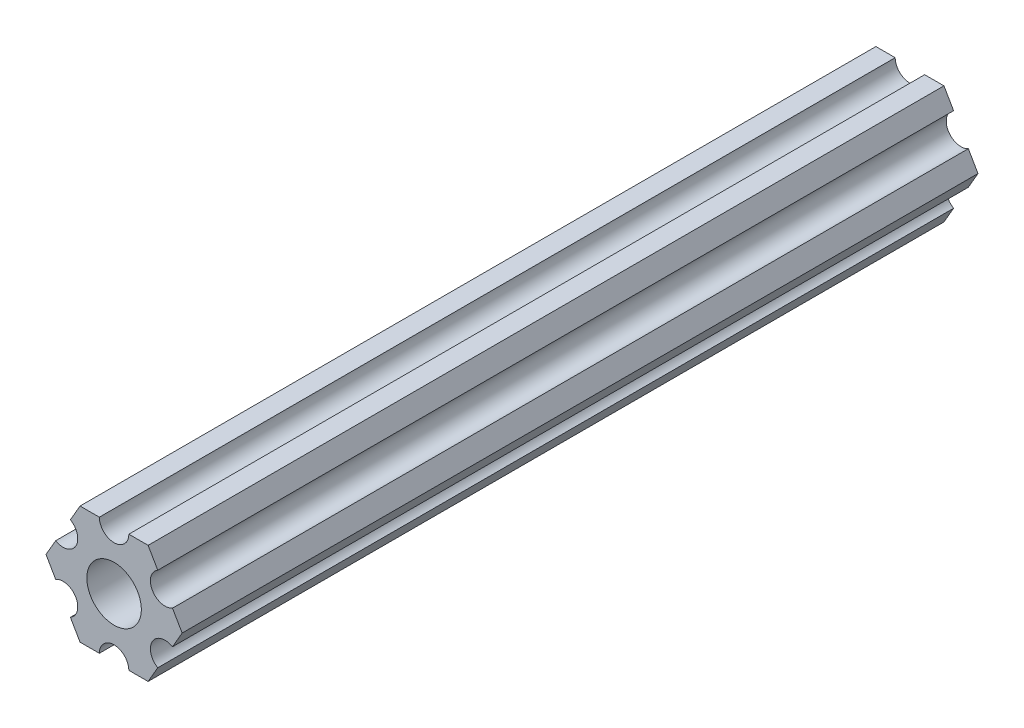
ISO-10303-21;
HEADER;
FILE_DESCRIPTION(('STEP AP214'),'2;1');
FILE_NAME('part.step','',(''),(''),'','','');
FILE_SCHEMA(('AUTOMOTIVE_DESIGN { 1 0 10303 214 1 1 1 1 }'));
ENDSEC;
DATA;
#1=APPLICATION_CONTEXT('core data for automotive mechanical design processes');
#2=APPLICATION_PROTOCOL_DEFINITION('international standard','automotive_design',2000,#1);
#3=PRODUCT_CONTEXT('',#1,'mechanical');
#4=PRODUCT('Part','Part','',(#3));
#5=PRODUCT_RELATED_PRODUCT_CATEGORY('part','',(#4));
#6=PRODUCT_DEFINITION_FORMATION('','',#4);
#7=PRODUCT_DEFINITION_CONTEXT('part definition',#1,'design');
#8=PRODUCT_DEFINITION('design','',#6,#7);
#9=PRODUCT_DEFINITION_SHAPE('','',#8);
#10=(LENGTH_UNIT() NAMED_UNIT(*) SI_UNIT(.MILLI.,.METRE.));
#11=(NAMED_UNIT(*) PLANE_ANGLE_UNIT() SI_UNIT($,.RADIAN.));
#12=(NAMED_UNIT(*) SI_UNIT($,.STERADIAN.) SOLID_ANGLE_UNIT());
#13=UNCERTAINTY_MEASURE_WITH_UNIT(LENGTH_MEASURE(1.E-05),#10,'distance_accuracy_value','');
#14=(GEOMETRIC_REPRESENTATION_CONTEXT(3) GLOBAL_UNCERTAINTY_ASSIGNED_CONTEXT((#13)) GLOBAL_UNIT_ASSIGNED_CONTEXT((#10,
#11,#12)) REPRESENTATION_CONTEXT('',''));
#15=CARTESIAN_POINT('',(0.,0.,0.));
#16=DIRECTION('',(0.,0.,1.));
#17=DIRECTION('',(1.,0.,0.));
#18=AXIS2_PLACEMENT_3D('',#15,#16,#17);
#19=CARTESIAN_POINT('',(6.29301142309098,-1.80018429024546,85.725));
#20=DIRECTION('',(-0.866025434075723,0.499999947533953,0.));
#21=DIRECTION('',(-0.499999947533953,-0.866025434075723,0.));
#22=AXIS2_PLACEMENT_3D('',#19,#20,#21);
#23=PLANE('',#22);
#24=DIRECTION('',(0.,0.,1.));
#25=VECTOR('',#24,1.);
#26=CARTESIAN_POINT('',(7.33234841870826,4.44212519169686E-07,85.725));
#27=LINE('',#26,#25);
#28=CARTESIAN_POINT('',(7.33234841870826,4.44212518961143E-07,0.));
#29=VERTEX_POINT('',#28);
#30=CARTESIAN_POINT('',(7.33234841870826,4.44212519315656E-07,85.725));
#31=VERTEX_POINT('',#30);
#32=EDGE_CURVE('E343',#29,#31,#27,.T.);
#33=ORIENTED_EDGE('',*,*,#32,.T.);
#34=DIRECTION('',(0.499999947533953,0.866025434075723,0.));
#35=VECTOR('',#34,1.);
#36=CARTESIAN_POINT('',(6.29301142309098,-1.80018429024546,85.725));
#37=LINE('',#36,#35);
#38=CARTESIAN_POINT('',(6.29301142309098,-1.80018429024546,85.725));
#39=VERTEX_POINT('',#38);
#40=EDGE_CURVE('E208',#39,#31,#37,.T.);
#41=ORIENTED_EDGE('',*,*,#40,.F.);
#42=DIRECTION('',(0.,0.,-1.));
#43=VECTOR('',#42,1.);
#44=CARTESIAN_POINT('',(6.29301142309098,-1.80018429024546,85.725));
#45=LINE('',#44,#43);
#46=CARTESIAN_POINT('',(6.29301142309098,-1.80018429024546,0.));
#47=VERTEX_POINT('',#46);
#48=EDGE_CURVE('E253',#39,#47,#45,.T.);
#49=ORIENTED_EDGE('',*,*,#48,.T.);
#50=DIRECTION('',(0.499999947533953,0.866025434075723,0.));
#51=VECTOR('',#50,1.);
#52=CARTESIAN_POINT('',(6.29301142309098,-1.80018429024546,0.));
#53=LINE('',#52,#51);
#54=EDGE_CURVE('E211',#47,#29,#53,.T.);
#55=ORIENTED_EDGE('',*,*,#54,.T.);
#56=EDGE_LOOP('',(#33,#41,#49,#55));
#57=FACE_BOUND('',#56,.T.);
#58=ADVANCED_FACE('F19',(#57),#23,.F.);
#59=CARTESIAN_POINT('',(7.33234841870826,4.44212519169686E-07,85.725));
#60=DIRECTION('',(-0.866025373493145,-0.500000052466056,0.));
#61=DIRECTION('',(0.500000052466056,-0.866025373493145,0.));
#62=AXIS2_PLACEMENT_3D('',#59,#60,#61);
#63=PLANE('',#62);
#64=DIRECTION('',(0.,0.,-1.));
#65=VECTOR('',#64,1.);
#66=CARTESIAN_POINT('',(6.29301120497139,1.80018505273895,85.725));
#67=LINE('',#66,#65);
#68=CARTESIAN_POINT('',(6.29301120497139,1.80018505273895,0.));
#69=VERTEX_POINT('',#68);
#70=CARTESIAN_POINT('',(6.29301120497139,1.80018505273895,85.725));
#71=VERTEX_POINT('',#70);
#72=EDGE_CURVE('E336',#69,#71,#67,.F.);
#73=ORIENTED_EDGE('',*,*,#72,.T.);
#74=DIRECTION('',(-0.500000052466056,0.866025373493145,0.));
#75=VECTOR('',#74,1.);
#76=CARTESIAN_POINT('',(7.33234841870826,4.44212519198905E-07,85.725));
#77=LINE('',#76,#75);
#78=EDGE_CURVE('E77',#31,#71,#77,.T.);
#79=ORIENTED_EDGE('',*,*,#78,.F.);
#80=ORIENTED_EDGE('',*,*,#32,.F.);
#81=DIRECTION('',(-0.500000052466056,0.866025373493145,0.));
#82=VECTOR('',#81,1.);
#83=CARTESIAN_POINT('',(7.33234841870826,4.44212519198905E-07,0.));
#84=LINE('',#83,#82);
#85=EDGE_CURVE('E250',#29,#69,#84,.T.);
#86=ORIENTED_EDGE('',*,*,#85,.T.);
#87=EDGE_LOOP('',(#73,#79,#80,#86));
#88=FACE_BOUND('',#87,.T.);
#89=ADVANCED_FACE('F415',(#88),#63,.F.);
#90=CARTESIAN_POINT('',(5.49926112168156,3.17500033315933,85.725));
#91=DIRECTION('',(0.,0.,-1.));
#92=DIRECTION('',(-1.,0.,0.));
#93=AXIS2_PLACEMENT_3D('',#90,#91,#92);
#94=CYLINDRICAL_SURFACE('',#93,1.5875);
#95=CARTESIAN_POINT('',(5.49926112168156,3.17500033315933,85.725));
#96=DIRECTION('',(0.,0.,-1.));
#97=DIRECTION('',(-1.,0.,0.));
#98=AXIS2_PLACEMENT_3D('',#95,#96,#97);
#99=CIRCLE('',#98,1.5875);
#100=CARTESIAN_POINT('',(4.70551103839172,4.54981561357972,85.725));
#101=VERTEX_POINT('',#100);
#102=EDGE_CURVE('E66',#71,#101,#99,.T.);
#103=ORIENTED_EDGE('',*,*,#102,.F.);
#104=ORIENTED_EDGE('',*,*,#72,.F.);
#105=CARTESIAN_POINT('',(5.49926112168156,3.17500033315933,0.));
#106=DIRECTION('',(0.,0.,-1.));
#107=DIRECTION('',(-1.,0.,0.));
#108=AXIS2_PLACEMENT_3D('',#105,#106,#107);
#109=CIRCLE('',#108,1.5875);
#110=CARTESIAN_POINT('',(4.70551103839172,4.54981561357972,0.));
#111=VERTEX_POINT('',#110);
#112=EDGE_CURVE('E22',#69,#111,#109,.T.);
#113=ORIENTED_EDGE('',*,*,#112,.T.);
#114=DIRECTION('',(0.,0.,1.));
#115=VECTOR('',#114,1.);
#116=CARTESIAN_POINT('',(4.70551103839172,4.54981561357972,85.725));
#117=LINE('',#116,#115);
#118=EDGE_CURVE('E331',#111,#101,#117,.T.);
#119=ORIENTED_EDGE('',*,*,#118,.T.);
#120=EDGE_LOOP('',(#103,#104,#113,#119));
#121=FACE_BOUND('',#120,.T.);
#122=ADVANCED_FACE('F419',(#121),#94,.F.);
#123=CARTESIAN_POINT('',(4.70551103839172,4.54981561357972,85.725));
#124=DIRECTION('',(-0.866025373493151,-0.500000052466046,0.));
#125=DIRECTION('',(0.500000052466046,-0.866025373493151,0.));
#126=AXIS2_PLACEMENT_3D('',#123,#124,#125);
#127=PLANE('',#126);
#128=DIRECTION('',(0.,0.,1.));
#129=VECTOR('',#128,1.);
#130=CARTESIAN_POINT('',(3.66617382465481,6.35000022210627,85.725));
#131=LINE('',#130,#129);
#132=CARTESIAN_POINT('',(3.66617382465481,6.35000022210627,0.));
#133=VERTEX_POINT('',#132);
#134=CARTESIAN_POINT('',(3.66617382465481,6.35000022210627,85.725));
#135=VERTEX_POINT('',#134);
#136=EDGE_CURVE('E327',#133,#135,#131,.T.);
#137=ORIENTED_EDGE('',*,*,#136,.T.);
#138=DIRECTION('',(-0.500000052466046,0.866025373493151,0.));
#139=VECTOR('',#138,1.);
#140=CARTESIAN_POINT('',(4.70551103839172,4.54981561357972,85.725));
#141=LINE('',#140,#139);
#142=EDGE_CURVE('E203',#101,#135,#141,.T.);
#143=ORIENTED_EDGE('',*,*,#142,.F.);
#144=ORIENTED_EDGE('',*,*,#118,.F.);
#145=DIRECTION('',(-0.500000052466046,0.866025373493151,0.));
#146=VECTOR('',#145,1.);
#147=CARTESIAN_POINT('',(4.70551103839172,4.54981561357972,0.));
#148=LINE('',#147,#146);
#149=EDGE_CURVE('E247',#111,#133,#148,.T.);
#150=ORIENTED_EDGE('',*,*,#149,.T.);
#151=EDGE_LOOP('',(#137,#143,#144,#150));
#152=FACE_BOUND('',#151,.T.);
#153=ADVANCED_FACE('F422',(#152),#127,.F.);
#154=CARTESIAN_POINT('',(3.66617382465481,6.35000022210627,85.725));
#155=DIRECTION('',(6.05825850611185E-08,-0.999999999999998,0.));
#156=DIRECTION('',(0.999999999999998,6.05825850611185E-08,0.));
#157=AXIS2_PLACEMENT_3D('',#154,#155,#156);
#158=PLANE('',#157);
#159=DIRECTION('',(0.,0.,-1.));
#160=VECTOR('',#159,1.);
#161=CARTESIAN_POINT('',(1.58749961530074,6.35000009617482,85.725));
#162=LINE('',#161,#160);
#163=CARTESIAN_POINT('',(1.58749961530073,6.35000015914054,0.));
#164=VERTEX_POINT('',#163);
#165=CARTESIAN_POINT('',(1.58749961530073,6.35000015914054,85.725));
#166=VERTEX_POINT('',#165);
#167=EDGE_CURVE('E319',#164,#166,#162,.F.);
#168=ORIENTED_EDGE('',*,*,#167,.T.);
#169=DIRECTION('',(1.,0.,0.));
#170=VECTOR('',#169,1.);
#171=CARTESIAN_POINT('',(5.49926112168156,6.35000022210627,85.725));
#172=LINE('',#171,#170);
#173=EDGE_CURVE('E169',#135,#166,#172,.F.);
#174=ORIENTED_EDGE('',*,*,#173,.F.);
#175=ORIENTED_EDGE('',*,*,#136,.F.);
#176=DIRECTION('',(1.,0.,0.));
#177=VECTOR('',#176,1.);
#178=CARTESIAN_POINT('',(5.49926112168156,6.35000022210627,0.));
#179=LINE('',#178,#177);
#180=EDGE_CURVE('E244',#133,#164,#179,.F.);
#181=ORIENTED_EDGE('',*,*,#180,.T.);
#182=EDGE_LOOP('',(#168,#174,#175,#181));
#183=FACE_BOUND('',#182,.T.);
#184=ADVANCED_FACE('F325',(#183),#158,.F.);
#185=CARTESIAN_POINT('',(-3.84699260060323E-07,6.35,85.725));
#186=DIRECTION('',(0.,0.,-1.));
#187=DIRECTION('',(-1.,0.,0.));
#188=AXIS2_PLACEMENT_3D('',#185,#186,#187);
#189=CYLINDRICAL_SURFACE('',#188,1.5875);
#190=DIRECTION('',(0.,0.,1.));
#191=VECTOR('',#190,1.);
#192=CARTESIAN_POINT('',(-1.58750038469926,6.34999990382518,85.725));
#193=LINE('',#192,#191);
#194=CARTESIAN_POINT('',(-1.58750038469926,6.34999990382518,0.));
#195=VERTEX_POINT('',#194);
#196=CARTESIAN_POINT('',(-1.58750038469926,6.34999990382518,85.725));
#197=VERTEX_POINT('',#196);
#198=EDGE_CURVE('E122',#195,#197,#193,.T.);
#199=ORIENTED_EDGE('',*,*,#198,.T.);
#200=CARTESIAN_POINT('',(-3.84699260060323E-07,6.35,85.725));
#201=DIRECTION('',(0.,0.,-1.));
#202=DIRECTION('',(-1.,0.,0.));
#203=AXIS2_PLACEMENT_3D('',#200,#201,#202);
#204=CIRCLE('',#203,1.5875);
#205=EDGE_CURVE('E174',#166,#197,#204,.T.);
#206=ORIENTED_EDGE('',*,*,#205,.F.);
#207=ORIENTED_EDGE('',*,*,#167,.F.);
#208=CARTESIAN_POINT('',(-3.84699260060323E-07,6.35,0.));
#209=DIRECTION('',(0.,0.,-1.));
#210=DIRECTION('',(-1.,0.,0.));
#211=AXIS2_PLACEMENT_3D('',#208,#209,#210);
#212=CIRCLE('',#211,1.5875);
#213=EDGE_CURVE('E243',#164,#195,#212,.T.);
#214=ORIENTED_EDGE('',*,*,#213,.T.);
#215=EDGE_LOOP('',(#199,#206,#207,#214));
#216=FACE_BOUND('',#215,.T.);
#217=ADVANCED_FACE('F318',(#216),#189,.F.);
#218=CARTESIAN_POINT('',(-1.58750038469926,6.34999990382518,85.725));
#219=DIRECTION('',(6.05825963273174E-08,-0.999999999999998,0.));
#220=DIRECTION('',(0.999999999999998,6.05825963273174E-08,0.));
#221=AXIS2_PLACEMENT_3D('',#218,#219,#220);
#222=PLANE('',#221);
#223=DIRECTION('',(0.,0.,1.));
#224=VECTOR('',#223,1.);
#225=CARTESIAN_POINT('',(-3.66617459405349,6.3499997778937,85.725));
#226=LINE('',#225,#224);
#227=CARTESIAN_POINT('',(-3.66617454558244,6.34999986184803,0.));
#228=VERTEX_POINT('',#227);
#229=CARTESIAN_POINT('',(-3.66617454558244,6.34999986184803,85.725));
#230=VERTEX_POINT('',#229);
#231=EDGE_CURVE('E130',#228,#230,#226,.T.);
#232=ORIENTED_EDGE('',*,*,#231,.T.);
#233=DIRECTION('',(1.,0.,0.));
#234=VECTOR('',#233,1.);
#235=CARTESIAN_POINT('',(5.49926112168156,6.34999990382518,85.725));
#236=LINE('',#235,#234);
#237=EDGE_CURVE('E176',#197,#230,#236,.F.);
#238=ORIENTED_EDGE('',*,*,#237,.F.);
#239=ORIENTED_EDGE('',*,*,#198,.F.);
#240=DIRECTION('',(1.,0.,0.));
#241=VECTOR('',#240,1.);
#242=CARTESIAN_POINT('',(5.49926112168156,6.34999990382518,0.));
#243=LINE('',#242,#241);
#244=EDGE_CURVE('E184',#195,#228,#243,.F.);
#245=ORIENTED_EDGE('',*,*,#244,.T.);
#246=EDGE_LOOP('',(#232,#238,#239,#245));
#247=FACE_BOUND('',#246,.T.);
#248=ADVANCED_FACE('F183',(#247),#222,.F.);
#249=CARTESIAN_POINT('',(-3.66617459405349,6.3499997778937,85.725));
#250=DIRECTION('',(0.866025434075729,-0.499999947533942,0.));
#251=DIRECTION('',(0.499999947533942,0.866025434075729,0.));
#252=AXIS2_PLACEMENT_3D('',#249,#250,#251);
#253=PLANE('',#252);
#254=DIRECTION('',(0.,0.,-1.));
#255=VECTOR('',#254,1.);
#256=CARTESIAN_POINT('',(-4.70551158967065,4.54981504343587,85.725));
#257=LINE('',#256,#255);
#258=CARTESIAN_POINT('',(-4.70551158967065,4.54981504343587,0.));
#259=VERTEX_POINT('',#258);
#260=CARTESIAN_POINT('',(-4.70551158967065,4.54981504343587,85.725));
#261=VERTEX_POINT('',#260);
#262=EDGE_CURVE('E186',#259,#261,#257,.F.);
#263=ORIENTED_EDGE('',*,*,#262,.T.);
#264=DIRECTION('',(-0.499999947533943,-0.866025434075729,0.));
#265=VECTOR('',#264,1.);
#266=CARTESIAN_POINT('',(-3.66617459405349,6.3499997778937,85.725));
#267=LINE('',#266,#265);
#268=EDGE_CURVE('E179',#230,#261,#267,.T.);
#269=ORIENTED_EDGE('',*,*,#268,.F.);
#270=ORIENTED_EDGE('',*,*,#231,.F.);
#271=DIRECTION('',(-0.499999947533943,-0.866025434075729,0.));
#272=VECTOR('',#271,1.);
#273=CARTESIAN_POINT('',(-3.66617459405349,6.3499997778937,0.));
#274=LINE('',#273,#272);
#275=EDGE_CURVE('E240',#228,#259,#274,.T.);
#276=ORIENTED_EDGE('',*,*,#275,.T.);
#277=EDGE_LOOP('',(#263,#269,#270,#276));
#278=FACE_BOUND('',#277,.T.);
#279=ADVANCED_FACE('F188',(#278),#253,.F.);
#280=CARTESIAN_POINT('',(-5.49926150638082,3.17499966684067,85.725));
#281=DIRECTION('',(0.,0.,-1.));
#282=DIRECTION('',(-1.,0.,0.));
#283=AXIS2_PLACEMENT_3D('',#280,#281,#282);
#284=CYLINDRICAL_SURFACE('',#283,1.5875);
#285=DIRECTION('',(0.,0.,1.));
#286=VECTOR('',#285,1.);
#287=CARTESIAN_POINT('',(-6.29301142309098,1.80018429024547,85.725));
#288=LINE('',#287,#286);
#289=CARTESIAN_POINT('',(-6.29301142309098,1.80018429024547,0.));
#290=VERTEX_POINT('',#289);
#291=CARTESIAN_POINT('',(-6.29301142309098,1.80018429024547,85.725));
#292=VERTEX_POINT('',#291);
#293=EDGE_CURVE('E289',#290,#292,#288,.T.);
#294=ORIENTED_EDGE('',*,*,#293,.T.);
#295=CARTESIAN_POINT('',(-5.49926150638082,3.17499966684067,85.725));
#296=DIRECTION('',(0.,0.,-1.));
#297=DIRECTION('',(-1.,0.,0.));
#298=AXIS2_PLACEMENT_3D('',#295,#296,#297);
#299=CIRCLE('',#298,1.5875);
#300=EDGE_CURVE('E191',#261,#292,#299,.T.);
#301=ORIENTED_EDGE('',*,*,#300,.F.);
#302=ORIENTED_EDGE('',*,*,#262,.F.);
#303=CARTESIAN_POINT('',(-5.49926150638082,3.17499966684067,0.));
#304=DIRECTION('',(0.,0.,-1.));
#305=DIRECTION('',(-1.,0.,0.));
#306=AXIS2_PLACEMENT_3D('',#303,#304,#305);
#307=CIRCLE('',#306,1.5875);
#308=EDGE_CURVE('E239',#259,#290,#307,.T.);
#309=ORIENTED_EDGE('',*,*,#308,.T.);
#310=EDGE_LOOP('',(#294,#301,#302,#309));
#311=FACE_BOUND('',#310,.T.);
#312=ADVANCED_FACE('F357',(#311),#284,.F.);
#313=CARTESIAN_POINT('',(-6.29301142309098,1.80018429024547,85.725));
#314=DIRECTION('',(0.866025434075724,-0.499999947533951,0.));
#315=DIRECTION('',(0.499999947533951,0.866025434075724,0.));
#316=AXIS2_PLACEMENT_3D('',#313,#314,#315);
#317=PLANE('',#316);
#318=DIRECTION('',(0.,0.,1.));
#319=VECTOR('',#318,1.);
#320=CARTESIAN_POINT('',(-7.33234841870826,-4.44212523790841E-07,85.725));
#321=LINE('',#320,#319);
#322=CARTESIAN_POINT('',(-7.33234841870826,-4.44212524036367E-07,0.));
#323=VERTEX_POINT('',#322);
#324=CARTESIAN_POINT('',(-7.33234841870826,-4.44212524036367E-07,85.725));
#325=VERTEX_POINT('',#324);
#326=EDGE_CURVE('E285',#323,#325,#321,.T.);
#327=ORIENTED_EDGE('',*,*,#326,.T.);
#328=DIRECTION('',(-0.499999947533952,-0.866025434075724,0.));
#329=VECTOR('',#328,1.);
#330=CARTESIAN_POINT('',(-6.29301142309098,1.80018429024547,85.725));
#331=LINE('',#330,#329);
#332=EDGE_CURVE('E196',#292,#325,#331,.T.);
#333=ORIENTED_EDGE('',*,*,#332,.F.);
#334=ORIENTED_EDGE('',*,*,#293,.F.);
#335=DIRECTION('',(-0.499999947533952,-0.866025434075724,0.));
#336=VECTOR('',#335,1.);
#337=CARTESIAN_POINT('',(-6.29301142309098,1.80018429024547,0.));
#338=LINE('',#337,#336);
#339=EDGE_CURVE('E236',#290,#323,#338,.T.);
#340=ORIENTED_EDGE('',*,*,#339,.T.);
#341=EDGE_LOOP('',(#327,#333,#334,#340));
#342=FACE_BOUND('',#341,.T.);
#343=ADVANCED_FACE('F362',(#342),#317,.F.);
#344=CARTESIAN_POINT('',(-7.33234841870826,-4.44212523790841E-07,85.725));
#345=DIRECTION('',(0.866025373493151,0.500000052466045,0.));
#346=DIRECTION('',(-0.500000052466045,0.866025373493151,0.));
#347=AXIS2_PLACEMENT_3D('',#344,#345,#346);
#348=PLANE('',#347);
#349=DIRECTION('',(0.,0.,-1.));
#350=VECTOR('',#349,1.);
#351=CARTESIAN_POINT('',(-6.29301120497141,-1.80018505273896,85.725));
#352=LINE('',#351,#350);
#353=CARTESIAN_POINT('',(-6.29301120497141,-1.80018505273896,0.));
#354=VERTEX_POINT('',#353);
#355=CARTESIAN_POINT('',(-6.29301120497141,-1.80018505273896,85.725));
#356=VERTEX_POINT('',#355);
#357=EDGE_CURVE('E280',#354,#356,#352,.F.);
#358=ORIENTED_EDGE('',*,*,#357,.T.);
#359=DIRECTION('',(0.500000052466045,-0.866025373493151,0.));
#360=VECTOR('',#359,1.);
#361=CARTESIAN_POINT('',(-7.33234841870826,-4.44212523969395E-07,85.725));
#362=LINE('',#361,#360);
#363=EDGE_CURVE('E366',#325,#356,#362,.T.);
#364=ORIENTED_EDGE('',*,*,#363,.F.);
#365=ORIENTED_EDGE('',*,*,#326,.F.);
#366=DIRECTION('',(0.500000052466045,-0.866025373493151,0.));
#367=VECTOR('',#366,1.);
#368=CARTESIAN_POINT('',(-7.33234841870826,-4.44212523969395E-07,0.));
#369=LINE('',#368,#367);
#370=EDGE_CURVE('E232',#323,#354,#369,.T.);
#371=ORIENTED_EDGE('',*,*,#370,.T.);
#372=EDGE_LOOP('',(#358,#364,#365,#371));
#373=FACE_BOUND('',#372,.T.);
#374=ADVANCED_FACE('F466',(#373),#348,.F.);
#375=CARTESIAN_POINT('',(-5.49926112168156,-3.17500033315934,85.725));
#376=DIRECTION('',(0.,0.,-1.));
#377=DIRECTION('',(-1.,0.,0.));
#378=AXIS2_PLACEMENT_3D('',#375,#376,#377);
#379=CYLINDRICAL_SURFACE('',#378,1.5875);
#380=DIRECTION('',(0.,0.,1.));
#381=VECTOR('',#380,1.);
#382=CARTESIAN_POINT('',(-4.70551103839172,-4.54981561357972,85.725));
#383=LINE('',#382,#381);
#384=CARTESIAN_POINT('',(-4.70551103839172,-4.54981561357972,0.));
#385=VERTEX_POINT('',#384);
#386=CARTESIAN_POINT('',(-4.70551103839172,-4.54981561357972,85.725));
#387=VERTEX_POINT('',#386);
#388=EDGE_CURVE('E274',#385,#387,#383,.T.);
#389=ORIENTED_EDGE('',*,*,#388,.T.);
#390=CARTESIAN_POINT('',(-5.49926112168156,-3.17500033315934,85.725));
#391=DIRECTION('',(0.,0.,-1.));
#392=DIRECTION('',(-1.,0.,0.));
#393=AXIS2_PLACEMENT_3D('',#390,#391,#392);
#394=CIRCLE('',#393,1.5875);
#395=EDGE_CURVE('E369',#356,#387,#394,.T.);
#396=ORIENTED_EDGE('',*,*,#395,.F.);
#397=ORIENTED_EDGE('',*,*,#357,.F.);
#398=CARTESIAN_POINT('',(-5.49926112168156,-3.17500033315934,0.));
#399=DIRECTION('',(0.,0.,-1.));
#400=DIRECTION('',(-1.,0.,0.));
#401=AXIS2_PLACEMENT_3D('',#398,#399,#400);
#402=CIRCLE('',#401,1.5875);
#403=EDGE_CURVE('E231',#354,#385,#402,.T.);
#404=ORIENTED_EDGE('',*,*,#403,.T.);
#405=EDGE_LOOP('',(#389,#396,#397,#404));
#406=FACE_BOUND('',#405,.T.);
#407=ADVANCED_FACE('F462',(#406),#379,.F.);
#408=CARTESIAN_POINT('',(-4.70551103839172,-4.54981561357972,85.725));
#409=DIRECTION('',(0.866025373493151,0.500000052466045,0.));
#410=DIRECTION('',(-0.500000052466045,0.866025373493151,0.));
#411=AXIS2_PLACEMENT_3D('',#408,#409,#410);
#412=PLANE('',#411);
#413=DIRECTION('',(0.,0.,1.));
#414=VECTOR('',#413,1.);
#415=CARTESIAN_POINT('',(-3.66617382465481,-6.35000022210628,85.725));
#416=LINE('',#415,#414);
#417=CARTESIAN_POINT('',(-3.6661738246548,-6.35000022210628,0.));
#418=VERTEX_POINT('',#417);
#419=CARTESIAN_POINT('',(-3.6661738246548,-6.35000022210628,85.725));
#420=VERTEX_POINT('',#419);
#421=EDGE_CURVE('E279',#418,#420,#416,.T.);
#422=ORIENTED_EDGE('',*,*,#421,.T.);
#423=DIRECTION('',(0.500000052466045,-0.866025373493151,0.));
#424=VECTOR('',#423,1.);
#425=CARTESIAN_POINT('',(-4.70551103839172,-4.54981561357972,85.725));
#426=LINE('',#425,#424);
#427=EDGE_CURVE('E371',#387,#420,#426,.T.);
#428=ORIENTED_EDGE('',*,*,#427,.F.);
#429=ORIENTED_EDGE('',*,*,#388,.F.);
#430=DIRECTION('',(0.500000052466045,-0.866025373493151,0.));
#431=VECTOR('',#430,1.);
#432=CARTESIAN_POINT('',(-4.70551103839172,-4.54981561357972,0.));
#433=LINE('',#432,#431);
#434=EDGE_CURVE('E227',#385,#418,#433,.T.);
#435=ORIENTED_EDGE('',*,*,#434,.T.);
#436=EDGE_LOOP('',(#422,#428,#429,#435));
#437=FACE_BOUND('',#436,.T.);
#438=ADVANCED_FACE('F458',(#437),#412,.F.);
#439=CARTESIAN_POINT('',(-3.66617382465481,-6.35000022210628,85.725));
#440=DIRECTION('',(-6.05825854783851E-08,0.999999999999998,0.));
#441=DIRECTION('',(-0.999999999999998,-6.05825854783851E-08,0.));
#442=AXIS2_PLACEMENT_3D('',#439,#440,#441);
#443=PLANE('',#442);
#444=DIRECTION('',(0.,0.,-1.));
#445=VECTOR('',#444,1.);
#446=CARTESIAN_POINT('',(-1.58749961530074,-6.35,85.725));
#447=LINE('',#446,#445);
#448=CARTESIAN_POINT('',(-1.58749961530073,-6.35000011105314,0.));
#449=VERTEX_POINT('',#448);
#450=CARTESIAN_POINT('',(-1.58749961530073,-6.35000011105314,85.725));
#451=VERTEX_POINT('',#450);
#452=EDGE_CURVE('E267',#449,#451,#447,.F.);
#453=ORIENTED_EDGE('',*,*,#452,.T.);
#454=DIRECTION('',(1.,0.,0.));
#455=VECTOR('',#454,1.);
#456=CARTESIAN_POINT('',(5.49926112168156,-6.35000022210628,85.725));
#457=LINE('',#456,#455);
#458=EDGE_CURVE('E377',#420,#451,#457,.T.);
#459=ORIENTED_EDGE('',*,*,#458,.F.);
#460=ORIENTED_EDGE('',*,*,#421,.F.);
#461=DIRECTION('',(1.,0.,0.));
#462=VECTOR('',#461,1.);
#463=CARTESIAN_POINT('',(5.49926112168156,-6.35000022210628,0.));
#464=LINE('',#463,#462);
#465=EDGE_CURVE('E223',#418,#449,#464,.T.);
#466=ORIENTED_EDGE('',*,*,#465,.T.);
#467=EDGE_LOOP('',(#453,#459,#460,#466));
#468=FACE_BOUND('',#467,.T.);
#469=ADVANCED_FACE('F455',(#468),#443,.F.);
#470=CARTESIAN_POINT('',(3.8469926204343E-07,-6.35,85.725));
#471=DIRECTION('',(0.,0.,-1.));
#472=DIRECTION('',(-1.,0.,0.));
#473=AXIS2_PLACEMENT_3D('',#470,#471,#472);
#474=CYLINDRICAL_SURFACE('',#473,1.5875);
#475=DIRECTION('',(0.,0.,1.));
#476=VECTOR('',#475,1.);
#477=CARTESIAN_POINT('',(1.58750038469926,-6.34999990382518,85.725));
#478=LINE('',#477,#476);
#479=CARTESIAN_POINT('',(1.58750038469926,-6.34999990382518,0.));
#480=VERTEX_POINT('',#479);
#481=CARTESIAN_POINT('',(1.58750038469926,-6.34999990382518,85.725));
#482=VERTEX_POINT('',#481);
#483=EDGE_CURVE('E262',#480,#482,#478,.T.);
#484=ORIENTED_EDGE('',*,*,#483,.T.);
#485=CARTESIAN_POINT('',(3.8469926204343E-07,-6.35,85.725));
#486=DIRECTION('',(0.,0.,-1.));
#487=DIRECTION('',(-1.,0.,0.));
#488=AXIS2_PLACEMENT_3D('',#485,#486,#487);
#489=CIRCLE('',#488,1.5875);
#490=EDGE_CURVE('E380',#451,#482,#489,.T.);
#491=ORIENTED_EDGE('',*,*,#490,.F.);
#492=ORIENTED_EDGE('',*,*,#452,.F.);
#493=CARTESIAN_POINT('',(3.8469926204343E-07,-6.35,0.));
#494=DIRECTION('',(0.,0.,-1.));
#495=DIRECTION('',(-1.,0.,0.));
#496=AXIS2_PLACEMENT_3D('',#493,#494,#495);
#497=CIRCLE('',#496,1.5875);
#498=EDGE_CURVE('E222',#449,#480,#497,.T.);
#499=ORIENTED_EDGE('',*,*,#498,.T.);
#500=EDGE_LOOP('',(#484,#491,#492,#499));
#501=FACE_BOUND('',#500,.T.);
#502=ADVANCED_FACE('F400',(#501),#474,.F.);
#503=CARTESIAN_POINT('',(1.58750038469926,-6.34999990382518,85.725));
#504=DIRECTION('',(-6.05825721258438E-08,0.999999999999998,0.));
#505=DIRECTION('',(-0.999999999999998,-6.05825721258438E-08,0.));
#506=AXIS2_PLACEMENT_3D('',#503,#504,#505);
#507=PLANE('',#506);
#508=DIRECTION('',(0.,0.,1.));
#509=VECTOR('',#508,1.);
#510=CARTESIAN_POINT('',(3.66617459405346,-6.34999977789375,85.725));
#511=LINE('',#510,#509);
#512=CARTESIAN_POINT('',(3.66617454558244,-6.34999986184804,0.));
#513=VERTEX_POINT('',#512);
#514=CARTESIAN_POINT('',(3.66617454558244,-6.34999986184804,85.725));
#515=VERTEX_POINT('',#514);
#516=EDGE_CURVE('E259',#513,#515,#511,.T.);
#517=ORIENTED_EDGE('',*,*,#516,.T.);
#518=DIRECTION('',(1.,0.,0.));
#519=VECTOR('',#518,1.);
#520=CARTESIAN_POINT('',(5.49926112168156,-6.34999990382518,85.725));
#521=LINE('',#520,#519);
#522=EDGE_CURVE('E381',#482,#515,#521,.T.);
#523=ORIENTED_EDGE('',*,*,#522,.F.);
#524=ORIENTED_EDGE('',*,*,#483,.F.);
#525=DIRECTION('',(1.,0.,0.));
#526=VECTOR('',#525,1.);
#527=CARTESIAN_POINT('',(5.49926112168156,-6.34999990382518,0.));
#528=LINE('',#527,#526);
#529=EDGE_CURVE('E218',#480,#513,#528,.T.);
#530=ORIENTED_EDGE('',*,*,#529,.T.);
#531=EDGE_LOOP('',(#517,#523,#524,#530));
#532=FACE_BOUND('',#531,.T.);
#533=ADVANCED_FACE('F404',(#532),#507,.F.);
#534=CARTESIAN_POINT('',(3.66617459405346,-6.34999977789375,85.725));
#535=DIRECTION('',(-0.86602543407573,0.499999947533941,0.));
#536=DIRECTION('',(-0.499999947533941,-0.86602543407573,0.));
#537=AXIS2_PLACEMENT_3D('',#534,#535,#536);
#538=PLANE('',#537);
#539=DIRECTION('',(0.,0.,1.));
#540=VECTOR('',#539,1.);
#541=CARTESIAN_POINT('',(4.70551158967065,-4.54981504343587,85.725));
#542=LINE('',#541,#540);
#543=CARTESIAN_POINT('',(4.70551158967065,-4.54981504343587,85.725));
#544=VERTEX_POINT('',#543);
#545=CARTESIAN_POINT('',(4.70551158967065,-4.54981504343587,0.));
#546=VERTEX_POINT('',#545);
#547=EDGE_CURVE('E256',#544,#546,#542,.F.);
#548=ORIENTED_EDGE('',*,*,#547,.F.);
#549=DIRECTION('',(0.49999994753394,0.86602543407573,0.));
#550=VECTOR('',#549,1.);
#551=CARTESIAN_POINT('',(3.66617459405346,-6.34999977789376,85.725));
#552=LINE('',#551,#550);
#553=EDGE_CURVE('E383',#515,#544,#552,.T.);
#554=ORIENTED_EDGE('',*,*,#553,.F.);
#555=ORIENTED_EDGE('',*,*,#516,.F.);
#556=DIRECTION('',(0.49999994753394,0.86602543407573,0.));
#557=VECTOR('',#556,1.);
#558=CARTESIAN_POINT('',(3.66617459405346,-6.34999977789376,0.));
#559=LINE('',#558,#557);
#560=EDGE_CURVE('E215',#513,#546,#559,.T.);
#561=ORIENTED_EDGE('',*,*,#560,.T.);
#562=EDGE_LOOP('',(#548,#554,#555,#561));
#563=FACE_BOUND('',#562,.T.);
#564=ADVANCED_FACE('F408',(#563),#538,.F.);
#565=CARTESIAN_POINT('',(5.49926150638082,-3.17499966684067,85.725));
#566=DIRECTION('',(0.,0.,-1.));
#567=DIRECTION('',(-1.,0.,0.));
#568=AXIS2_PLACEMENT_3D('',#565,#566,#567);
#569=CYLINDRICAL_SURFACE('',#568,1.58750000000001);
#570=CARTESIAN_POINT('',(5.49926150638082,-3.17499966684067,85.725));
#571=DIRECTION('',(0.,0.,-1.));
#572=DIRECTION('',(-1.,0.,0.));
#573=AXIS2_PLACEMENT_3D('',#570,#571,#572);
#574=CIRCLE('',#573,1.58750000000001);
#575=EDGE_CURVE('E42',#544,#39,#574,.T.);
#576=ORIENTED_EDGE('',*,*,#575,.F.);
#577=ORIENTED_EDGE('',*,*,#547,.T.);
#578=CARTESIAN_POINT('',(5.49926150638082,-3.17499966684067,0.));
#579=DIRECTION('',(0.,0.,-1.));
#580=DIRECTION('',(-1.,0.,0.));
#581=AXIS2_PLACEMENT_3D('',#578,#579,#580);
#582=CIRCLE('',#581,1.58750000000001);
#583=EDGE_CURVE('E214',#546,#47,#582,.T.);
#584=ORIENTED_EDGE('',*,*,#583,.T.);
#585=ORIENTED_EDGE('',*,*,#48,.F.);
#586=EDGE_LOOP('',(#576,#577,#584,#585));
#587=FACE_BOUND('',#586,.T.);
#588=ADVANCED_FACE('F409',(#587),#569,.F.);
#589=CARTESIAN_POINT('',(5.49926112168156,3.17500033315933,0.));
#590=DIRECTION('',(0.,0.,1.));
#591=DIRECTION('',(1.,0.,0.));
#592=AXIS2_PLACEMENT_3D('',#589,#590,#591);
#593=PLANE('',#592);
#594=CARTESIAN_POINT('',(0.,0.,0.));
#595=DIRECTION('',(0.,0.,-1.));
#596=DIRECTION('',(-1.,0.,0.));
#597=AXIS2_PLACEMENT_3D('',#594,#595,#596);
#598=CIRCLE('',#597,2.9337);
#599=CARTESIAN_POINT('',(-2.9337,0.,0.));
#600=VERTEX_POINT('',#599);
#601=EDGE_CURVE('E29',#600,#600,#598,.F.);
#602=ORIENTED_EDGE('',*,*,#601,.T.);
#603=EDGE_LOOP('',(#602));
#604=FACE_BOUND('',#603,.T.);
#605=ORIENTED_EDGE('',*,*,#583,.F.);
#606=ORIENTED_EDGE('',*,*,#560,.F.);
#607=ORIENTED_EDGE('',*,*,#529,.F.);
#608=ORIENTED_EDGE('',*,*,#498,.F.);
#609=ORIENTED_EDGE('',*,*,#465,.F.);
#610=ORIENTED_EDGE('',*,*,#434,.F.);
#611=ORIENTED_EDGE('',*,*,#403,.F.);
#612=ORIENTED_EDGE('',*,*,#370,.F.);
#613=ORIENTED_EDGE('',*,*,#339,.F.);
#614=ORIENTED_EDGE('',*,*,#308,.F.);
#615=ORIENTED_EDGE('',*,*,#275,.F.);
#616=ORIENTED_EDGE('',*,*,#244,.F.);
#617=ORIENTED_EDGE('',*,*,#213,.F.);
#618=ORIENTED_EDGE('',*,*,#180,.F.);
#619=ORIENTED_EDGE('',*,*,#149,.F.);
#620=ORIENTED_EDGE('',*,*,#112,.F.);
#621=ORIENTED_EDGE('',*,*,#85,.F.);
#622=ORIENTED_EDGE('',*,*,#54,.F.);
#623=EDGE_LOOP('',(#605,#606,#607,#608,#609,#610,#611,#612,#613,#614,#615,#616,#617,#618,#619,
#620,#621,#622));
#624=FACE_BOUND('',#623,.T.);
#625=ADVANCED_FACE('F322',(#604,#624),#593,.F.);
#626=CARTESIAN_POINT('',(5.49926112168156,3.17500033315933,85.725));
#627=DIRECTION('',(0.,0.,1.));
#628=DIRECTION('',(1.,0.,0.));
#629=AXIS2_PLACEMENT_3D('',#626,#627,#628);
#630=PLANE('',#629);
#631=CARTESIAN_POINT('',(0.,0.,85.725));
#632=DIRECTION('',(0.,0.,-1.));
#633=DIRECTION('',(-1.,0.,0.));
#634=AXIS2_PLACEMENT_3D('',#631,#632,#633);
#635=CIRCLE('',#634,2.9337);
#636=CARTESIAN_POINT('',(-2.9337,0.,85.725));
#637=VERTEX_POINT('',#636);
#638=EDGE_CURVE('E12',#637,#637,#635,.T.);
#639=ORIENTED_EDGE('',*,*,#638,.T.);
#640=EDGE_LOOP('',(#639));
#641=FACE_BOUND('',#640,.T.);
#642=ORIENTED_EDGE('',*,*,#553,.T.);
#643=ORIENTED_EDGE('',*,*,#575,.T.);
#644=ORIENTED_EDGE('',*,*,#40,.T.);
#645=ORIENTED_EDGE('',*,*,#78,.T.);
#646=ORIENTED_EDGE('',*,*,#102,.T.);
#647=ORIENTED_EDGE('',*,*,#142,.T.);
#648=ORIENTED_EDGE('',*,*,#173,.T.);
#649=ORIENTED_EDGE('',*,*,#205,.T.);
#650=ORIENTED_EDGE('',*,*,#237,.T.);
#651=ORIENTED_EDGE('',*,*,#268,.T.);
#652=ORIENTED_EDGE('',*,*,#300,.T.);
#653=ORIENTED_EDGE('',*,*,#332,.T.);
#654=ORIENTED_EDGE('',*,*,#363,.T.);
#655=ORIENTED_EDGE('',*,*,#395,.T.);
#656=ORIENTED_EDGE('',*,*,#427,.T.);
#657=ORIENTED_EDGE('',*,*,#458,.T.);
#658=ORIENTED_EDGE('',*,*,#490,.T.);
#659=ORIENTED_EDGE('',*,*,#522,.T.);
#660=EDGE_LOOP('',(#642,#643,#644,#645,#646,#647,#648,#649,#650,#651,#652,#653,#654,#655,#656,
#657,#658,#659));
#661=FACE_BOUND('',#660,.T.);
#662=ADVANCED_FACE('F178',(#641,#661),#630,.T.);
#663=CARTESIAN_POINT('',(0.,0.,85.725));
#664=DIRECTION('',(0.,0.,-1.));
#665=DIRECTION('',(-1.,0.,0.));
#666=AXIS2_PLACEMENT_3D('',#663,#664,#665);
#667=CYLINDRICAL_SURFACE('',#666,2.9337);
#668=ORIENTED_EDGE('',*,*,#601,.F.);
#669=EDGE_LOOP('',(#668));
#670=FACE_BOUND('',#669,.T.);
#671=ORIENTED_EDGE('',*,*,#638,.F.);
#672=EDGE_LOOP('',(#671));
#673=FACE_BOUND('',#672,.T.);
#674=ADVANCED_FACE('F432',(#670,#673),#667,.F.);
#675=CLOSED_SHELL('',(#58,#89,#122,#153,#184,#217,#248,#279,#312,#343,#374,#407,#438,#469,#502,
#533,#564,#588,#625,#662,#674));
#676=MANIFOLD_SOLID_BREP('B1',#675);
#677=ADVANCED_BREP_SHAPE_REPRESENTATION('',(#18,#676),#14);
#678=SHAPE_DEFINITION_REPRESENTATION(#9,#677);
ENDSEC;
END-ISO-10303-21;
